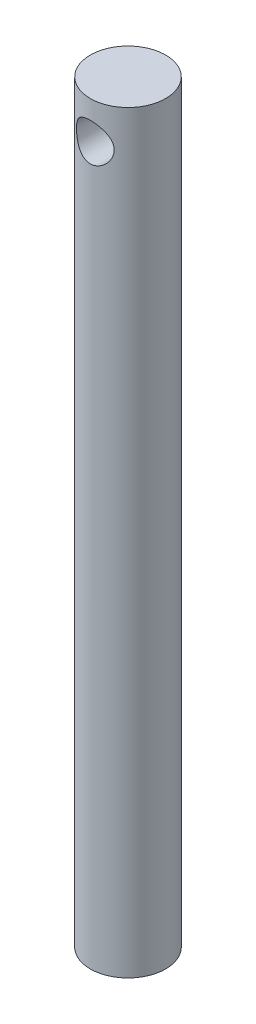
ISO-10303-21;
HEADER;
FILE_DESCRIPTION(('STEP AP214'),'2;1');
FILE_NAME('part.step','',(''),(''),'','','');
FILE_SCHEMA(('AUTOMOTIVE_DESIGN { 1 0 10303 214 1 1 1 1 }'));
ENDSEC;
DATA;
#1=APPLICATION_CONTEXT('core data for automotive mechanical design processes');
#2=APPLICATION_PROTOCOL_DEFINITION('international standard','automotive_design',2000,#1);
#3=PRODUCT_CONTEXT('',#1,'mechanical');
#4=PRODUCT('Part','Part','',(#3));
#5=PRODUCT_RELATED_PRODUCT_CATEGORY('part','',(#4));
#6=PRODUCT_DEFINITION_FORMATION('','',#4);
#7=PRODUCT_DEFINITION_CONTEXT('part definition',#1,'design');
#8=PRODUCT_DEFINITION('design','',#6,#7);
#9=PRODUCT_DEFINITION_SHAPE('','',#8);
#10=(LENGTH_UNIT() NAMED_UNIT(*) SI_UNIT(.MILLI.,.METRE.));
#11=(NAMED_UNIT(*) PLANE_ANGLE_UNIT() SI_UNIT($,.RADIAN.));
#12=(NAMED_UNIT(*) SI_UNIT($,.STERADIAN.) SOLID_ANGLE_UNIT());
#13=UNCERTAINTY_MEASURE_WITH_UNIT(LENGTH_MEASURE(1.E-05),#10,'distance_accuracy_value','');
#14=(GEOMETRIC_REPRESENTATION_CONTEXT(3) GLOBAL_UNCERTAINTY_ASSIGNED_CONTEXT((#13)) GLOBAL_UNIT_ASSIGNED_CONTEXT((#10,
#11,#12)) REPRESENTATION_CONTEXT('',''));
#15=CARTESIAN_POINT('',(0.,0.,0.));
#16=DIRECTION('',(0.,0.,1.));
#17=DIRECTION('',(1.,0.,0.));
#18=AXIS2_PLACEMENT_3D('',#15,#16,#17);
#19=CARTESIAN_POINT('',(0.,100.,0.));
#20=DIRECTION('',(0.,-1.,0.));
#21=DIRECTION('',(0.,0.,-1.));
#22=AXIS2_PLACEMENT_3D('',#19,#20,#21);
#23=CYLINDRICAL_SURFACE('',#22,5.);
#24=CARTESIAN_POINT('',(-2.50000000000001,95.,4.33012701892219));
#25=CARTESIAN_POINT('',(-2.49998948436432,94.8697334931235,4.33013982272991));
#26=CARTESIAN_POINT('',(-2.48974954513169,94.7392972793238,4.33609541965583));
#27=CARTESIAN_POINT('',(-2.44930840724944,94.4824310284708,4.35905877051907));
#28=CARTESIAN_POINT('',(-2.41906526369545,94.3560099959427,4.37608974726023));
#29=CARTESIAN_POINT('',(-2.34024976997571,94.1113710544389,4.41873376871658));
#30=CARTESIAN_POINT('',(-2.29177485369964,93.9931134264378,4.44430111338921));
#31=CARTESIAN_POINT('',(-2.17816884056414,93.7664394369054,4.50106659111455));
#32=CARTESIAN_POINT('',(-2.11303684262671,93.6580236082042,4.53226502875883));
#33=CARTESIAN_POINT('',(-1.96166634317253,93.4442356960831,4.59992173524851));
#34=CARTESIAN_POINT('',(-1.87413008816917,93.3398521655102,4.63660159331577));
#35=CARTESIAN_POINT('',(-1.68313452122752,93.1464790242868,4.70929956727453));
#36=CARTESIAN_POINT('',(-1.57966731506051,93.057497092245,4.74531734512768));
#37=CARTESIAN_POINT('',(-1.35122390789082,92.8915821235144,4.81553692452135));
#38=CARTESIAN_POINT('',(-1.22526797235894,92.8158655807209,4.84945266064072));
#39=CARTESIAN_POINT('',(-0.960392566671152,92.6871478665161,4.90876890230193));
#40=CARTESIAN_POINT('',(-0.82148134538999,92.6341323595615,4.93417477954535));
#41=CARTESIAN_POINT('',(-0.545112359773533,92.556238346836,4.9720115311507));
#42=CARTESIAN_POINT('',(-0.408254476210992,92.5296261841349,4.98523700553425));
#43=CARTESIAN_POINT('',(-0.131426571755684,92.4995847032887,5.00018959613973));
#44=CARTESIAN_POINT('',(0.00854151460650149,92.4961413580046,5.00192366961168));
#45=CARTESIAN_POINT('',(0.274581311061957,92.5118666849314,4.99407454791405));
#46=CARTESIAN_POINT('',(0.400802997942664,92.5290950388045,4.98546239730476));
#47=CARTESIAN_POINT('',(0.648284429795102,92.5822021097601,4.95935613149294));
#48=CARTESIAN_POINT('',(0.76954380273462,92.6180822224402,4.94186135165964));
#49=CARTESIAN_POINT('',(1.00577347892407,92.7077064152249,4.89928958219157));
#50=CARTESIAN_POINT('',(1.12063355878799,92.7616907829303,4.87411103823004));
#51=CARTESIAN_POINT('',(1.33994200378326,92.8856585405036,4.81844114966713));
#52=CARTESIAN_POINT('',(1.44438662209659,92.9556476582558,4.78794790393709));
#53=CARTESIAN_POINT('',(1.6504341522455,93.1172383788326,4.72110985998075));
#54=CARTESIAN_POINT('',(1.7508351875734,93.210257570815,4.68448439995438));
#55=CARTESIAN_POINT('',(1.93526092574444,93.4114743123254,4.61135851467029));
#56=CARTESIAN_POINT('',(2.01927302893557,93.5196834306851,4.57485820664072));
#57=CARTESIAN_POINT('',(2.17376333660553,93.7566204810602,4.50360390231212));
#58=CARTESIAN_POINT('',(2.24304328744513,93.8862150576355,4.46910799976769));
#59=CARTESIAN_POINT('',(2.35829778250308,94.1573441783975,4.4093862569644));
#60=CARTESIAN_POINT('',(2.40429664552722,94.2988660825439,4.38415075115168));
#61=CARTESIAN_POINT('',(2.4679505275626,94.578036278207,4.34861589542586));
#62=CARTESIAN_POINT('',(2.48756280529994,94.7151027976089,4.33729139621241));
#63=CARTESIAN_POINT('',(2.50379236652857,94.9910033537914,4.32794798404024));
#64=CARTESIAN_POINT('',(2.50042589328757,95.1298360727995,4.32991967223279));
#65=CARTESIAN_POINT('',(2.47259010835991,95.3891347964468,4.34585841351462));
#66=CARTESIAN_POINT('',(2.45046954178116,95.5099486277697,4.35848968766635));
#67=CARTESIAN_POINT('',(2.38924071158111,95.7459194656775,4.39235053878353));
#68=CARTESIAN_POINT('',(2.35012694655908,95.8610746268669,4.41358290012585));
#69=CARTESIAN_POINT('',(2.25411897151217,96.0885283272564,4.46340555199141));
#70=CARTESIAN_POINT('',(2.19648515923163,96.2004475421326,4.49229108107657));
#71=CARTESIAN_POINT('',(2.0657176600397,96.4136731788488,4.55390298743125));
#72=CARTESIAN_POINT('',(1.99257601083123,96.5149741087881,4.58663133387872));
#73=CARTESIAN_POINT('',(1.82209291799636,96.7174469188033,4.65719996140836));
#74=CARTESIAN_POINT('',(1.72286318078435,96.8169928767722,4.69516457885707));
#75=CARTESIAN_POINT('',(1.5085112384988,96.9985305950059,4.76835587444746));
#76=CARTESIAN_POINT('',(1.39338368664989,97.0805164256585,4.80358162519329));
#77=CARTESIAN_POINT('',(1.14633840638508,97.2264343147909,4.86853404227334));
#78=CARTESIAN_POINT('',(1.01405774389062,97.2898327952085,4.89809104179855));
#79=CARTESIAN_POINT('',(0.738805911647338,97.392844759962,4.9470838739847));
#80=CARTESIAN_POINT('',(0.595844253647071,97.4324791296051,4.96652859191746));
#81=CARTESIAN_POINT('',(0.317449205674709,97.4834214093564,4.99168770453968));
#82=CARTESIAN_POINT('',(0.18252860908538,97.4969946858304,4.99849819767838));
#83=CARTESIAN_POINT('',(-0.0878149643374271,97.5021081674946,5.00105325940467));
#84=CARTESIAN_POINT('',(-0.223237748727012,97.4936560856611,4.99680170177042));
#85=CARTESIAN_POINT('',(-0.481344982671069,97.4564589696045,4.97834922085637));
#86=CARTESIAN_POINT('',(-0.604280801321769,97.4290878283637,4.96482236636807));
#87=CARTESIAN_POINT('',(-0.843614873664451,97.3566825502417,4.92980234191731));
#88=CARTESIAN_POINT('',(-0.960012187087209,97.3116458803664,4.90830802955518));
#89=CARTESIAN_POINT('',(-1.18855854199592,97.2031821812607,4.85814826741488));
#90=CARTESIAN_POINT('',(-1.30031295715362,97.1390509753102,4.82921542506803));
#91=CARTESIAN_POINT('',(-1.51193650408535,96.9951058898524,4.76720333344986));
#92=CARTESIAN_POINT('',(-1.61180014305397,96.9152848073731,4.73412218229104));
#93=CARTESIAN_POINT('',(-1.80728542324369,96.7330042055506,4.66321523550925));
#94=CARTESIAN_POINT('',(-1.90149582349002,96.6290822739993,4.62524489658367));
#95=CARTESIAN_POINT('',(-2.07165660492503,96.4063847146178,4.55157698284941));
#96=CARTESIAN_POINT('',(-2.1475908315154,96.2875960858008,4.51588143910584));
#97=CARTESIAN_POINT('',(-2.28108393396029,96.0333638823358,4.44998982823926));
#98=CARTESIAN_POINT('',(-2.3379862797745,95.8975126115754,4.42000320346984));
#99=CARTESIAN_POINT('',(-2.40494911880459,95.6867773504802,4.38370272660093));
#100=CARTESIAN_POINT('',(-2.42419582683991,95.6154402243024,4.37305486646054));
#101=CARTESIAN_POINT('',(-2.45635087255789,95.4709593031507,4.35507574170935));
#102=CARTESIAN_POINT('',(-2.46926364179177,95.3978168090456,4.34774215854234));
#103=CARTESIAN_POINT('',(-2.48591166201424,95.2704990134531,4.3382377954292));
#104=CARTESIAN_POINT('',(-2.49118864979203,95.2165836784878,4.33520487024791));
#105=CARTESIAN_POINT('',(-2.49823512543934,95.1084553836896,4.33114674911322));
#106=CARTESIAN_POINT('',(-2.50000437866475,95.0542424041894,4.33012168747261));
#107=CARTESIAN_POINT('',(-2.50000000000001,95.,4.33012701892219));
#108=B_SPLINE_CURVE_WITH_KNOTS('',3,(#24,#25,#26,#27,#28,#29,#30,#31,#32,#33,#34,#35,#36,#37,
#38,#39,#40,#41,#42,#43,#44,#45,#46,#47,#48,#49,#50,#51,#52,#53,#54,#55,#56,#57,#58,#59,#60,#61,
#62,#63,#64,#65,#66,#67,#68,#69,#70,#71,#72,#73,#74,#75,#76,#77,#78,#79,#80,#81,#82,#83,#84,#85,
#86,#87,#88,#89,#90,#91,#92,#93,#94,#95,#96,#97,#98,#99,#100,#101,#102,#103,#104,#105,#106,
#107),.UNSPECIFIED.,.T.,.F.,(4,2,2,2,2,2,2,2,2,2,2,2,2,2,2,2,2,2,2,2,2,2,2,2,2,2,2,2,2,2,2,2,2,
2,2,2,2,2,2,2,2,4),(0.,0.390580306486802,0.781982232062008,1.17132148982694,1.56068181366371,
1.98215578129642,2.40383927716011,2.85394730601992,3.30377067414811,3.72158712424921,
4.13915059220184,4.52040243716429,4.90168281298721,5.2882383683295,5.67493248380763,
6.09817978647309,6.5217512061988,6.97222104328705,7.42221935534347,7.83655727140614,
8.25060232976017,8.61935458565149,8.98822631095242,9.37418241020304,9.76033715555203,
10.1951685895662,10.6301466245059,11.076604535375,11.5226694952701,11.927806759788,
12.3328021699001,12.7111106218382,13.0894733378512,13.4840187680376,13.8787457525688,
14.3127560463025,14.7471485711797,15.195268726016,15.4189244153949,15.6424233996907,
15.8050484542806,15.9676843870379),.UNSPECIFIED.);
#109=CARTESIAN_POINT('',(-2.50000000000001,95.,4.33012701892219));
#110=VERTEX_POINT('',#109);
#111=EDGE_CURVE('E50',#110,#110,#108,.T.);
#112=ORIENTED_EDGE('',*,*,#111,.F.);
#113=EDGE_LOOP('',(#112));
#114=FACE_BOUND('',#113,.T.);
#115=CARTESIAN_POINT('',(0.,100.,0.));
#116=DIRECTION('',(0.,1.,0.));
#117=DIRECTION('',(0.,0.,1.));
#118=AXIS2_PLACEMENT_3D('',#115,#116,#117);
#119=CIRCLE('',#118,5.);
#120=CARTESIAN_POINT('',(0.,100.,5.));
#121=VERTEX_POINT('',#120);
#122=EDGE_CURVE('E10',#121,#121,#119,.T.);
#123=ORIENTED_EDGE('',*,*,#122,.F.);
#124=EDGE_LOOP('',(#123));
#125=FACE_BOUND('',#124,.T.);
#126=CARTESIAN_POINT('',(0.,0.,0.));
#127=DIRECTION('',(0.,1.,0.));
#128=DIRECTION('',(0.,0.,1.));
#129=AXIS2_PLACEMENT_3D('',#126,#127,#128);
#130=CIRCLE('',#129,5.);
#131=CARTESIAN_POINT('',(0.,0.,5.));
#132=VERTEX_POINT('',#131);
#133=EDGE_CURVE('E44',#132,#132,#130,.T.);
#134=ORIENTED_EDGE('',*,*,#133,.T.);
#135=EDGE_LOOP('',(#134));
#136=FACE_BOUND('',#135,.T.);
#137=CARTESIAN_POINT('',(0.,97.5,-5.));
#138=CARTESIAN_POINT('',(0.131426682334305,97.499990330944,-4.99999177550472));
#139=CARTESIAN_POINT('',(0.263015634437213,97.489574438226,-4.99476199135277));
#140=CARTESIAN_POINT('',(0.522301454622884,97.448368178838,-4.9743541856102));
#141=CARTESIAN_POINT('',(0.649990448564106,97.417539119075,-4.9591572718767));
#142=CARTESIAN_POINT('',(0.897333631316202,97.3370153772812,-4.92040690922477));
#143=CARTESIAN_POINT('',(1.01701694536277,97.2873940122173,-4.89688595907259));
#144=CARTESIAN_POINT('',(1.2461816039967,97.1710734737482,-4.84364443325827));
#145=CARTESIAN_POINT('',(1.35566375203769,97.1043756468549,-4.81392434644421));
#146=CARTESIAN_POINT('',(1.56876952630998,96.9512068683574,-4.74890645050632));
#147=CARTESIAN_POINT('',(1.67163802294309,96.8637837997702,-4.71337997659091));
#148=CARTESIAN_POINT('',(1.86194861703333,96.6736963040147,-4.64149925776731));
#149=CARTESIAN_POINT('',(1.94937895911555,96.5710203711599,-4.60514440566897));
#150=CARTESIAN_POINT('',(2.11312999967247,96.3437916255547,-4.53247377945622));
#151=CARTESIAN_POINT('',(2.18806333849064,96.218159753965,-4.49637967412567));
#152=CARTESIAN_POINT('',(2.31542056761491,95.9540816602046,-4.43214946943555));
#153=CARTESIAN_POINT('',(2.36786053751683,95.8156446782374,-4.40400769020792));
#154=CARTESIAN_POINT('',(2.44533110537653,95.5383372364036,-4.36144667591402));
#155=CARTESIAN_POINT('',(2.47181464267579,95.3999888698204,-4.34630678958452));
#156=CARTESIAN_POINT('',(2.50106748329741,95.1200529055624,-4.3295472487215));
#157=CARTESIAN_POINT('',(2.50386022093906,94.9784686478249,-4.3279142335843));
#158=CARTESIAN_POINT('',(2.48671821792512,94.7142849392091,-4.33777325642937));
#159=CARTESIAN_POINT('',(2.46946139884055,94.5914399219417,-4.34771909154984));
#160=CARTESIAN_POINT('',(2.41734962264384,94.350695226568,-4.37690571834675));
#161=CARTESIAN_POINT('',(2.38248905974454,94.2327971367369,-4.39614947079454));
#162=CARTESIAN_POINT('',(2.29552445096459,94.0019271685857,-4.44218691031839));
#163=CARTESIAN_POINT('',(2.24303766778988,93.8891340030355,-4.46914601659992));
#164=CARTESIAN_POINT('',(2.12260421917012,93.673414268525,-4.52758510703513));
#165=CARTESIAN_POINT('',(2.0546506095312,93.5704921609998,-4.55906711950478));
#166=CARTESIAN_POINT('',(1.89516513728193,93.3636968681419,-4.62782894758213));
#167=CARTESIAN_POINT('',(1.80173614592319,93.2613578160596,-4.66533775591865));
#168=CARTESIAN_POINT('',(1.59888894685344,93.0731614535227,-4.73869058251019));
#169=CARTESIAN_POINT('',(1.48946314143571,92.9873120199153,-4.77453379897003));
#170=CARTESIAN_POINT('',(1.25129126457961,92.8307858474257,-4.84254968207409));
#171=CARTESIAN_POINT('',(1.12188397899852,92.7609988188857,-4.87447460405015));
#172=CARTESIAN_POINT('',(0.851165538721983,92.6447574273925,-4.92894702803109));
#173=CARTESIAN_POINT('',(0.709863940663162,92.5982845374621,-4.95150197358893));
#174=CARTESIAN_POINT('',(0.431916229151782,92.5338114907083,-4.98310834353579));
#175=CARTESIAN_POINT('',(0.295853826370907,92.513771910633,-4.9931234575324));
#176=CARTESIAN_POINT('',(0.0219489998732887,92.4963381721638,-5.00182533647794));
#177=CARTESIAN_POINT('',(-0.115892549675109,92.4989332859015,-5.00051746803426));
#178=CARTESIAN_POINT('',(-0.378082429964656,92.5255167210467,-4.98727980633468));
#179=CARTESIAN_POINT('',(-0.502648520123706,92.5478313318244,-4.97618114219992));
#180=CARTESIAN_POINT('',(-0.746017230755972,92.6105951797384,-4.94555428287529));
#181=CARTESIAN_POINT('',(-0.864819214231884,92.6510464161359,-4.92602515837625));
#182=CARTESIAN_POINT('',(-1.09722152111965,92.7499961660804,-4.87960628532329));
#183=CARTESIAN_POINT('',(-1.21057599249831,92.8089776252823,-4.85252204417873));
#184=CARTESIAN_POINT('',(-1.42615340426439,92.9427688391248,-4.7935993579975));
#185=CARTESIAN_POINT('',(-1.52837157450204,93.0175853365199,-4.76175888940534));
#186=CARTESIAN_POINT('',(-1.72941922315487,93.1894010632909,-4.69270553315086));
#187=CARTESIAN_POINT('',(-1.82693019428496,93.2878571709752,-4.65527212009488));
#188=CARTESIAN_POINT('',(-2.0046408025722,93.4998128780494,-4.58155978921587));
#189=CARTESIAN_POINT('',(-2.08482846428686,93.6133227970699,-4.54528168472407));
#190=CARTESIAN_POINT('',(-2.22926978618995,93.8591091354846,-4.47627980545279));
#191=CARTESIAN_POINT('',(-2.29256373922244,93.9920281652911,-4.44381323981254));
#192=CARTESIAN_POINT('',(-2.39520706511459,94.2687751688825,-4.38935180726745));
#193=CARTESIAN_POINT('',(-2.43458729077056,94.412588816,-4.36734345549014));
#194=CARTESIAN_POINT('',(-2.48465421767006,94.6922755573629,-4.33903752569351));
#195=CARTESIAN_POINT('',(-2.49773248744361,94.827585634119,-4.33143458674096));
#196=CARTESIAN_POINT('',(-2.50172288950899,95.0986176673807,-4.32913386592579));
#197=CARTESIAN_POINT('',(-2.49264462983266,95.2343394198736,-4.3344304902511));
#198=CARTESIAN_POINT('',(-2.45481530197332,95.4887087556169,-4.35594655164663));
#199=CARTESIAN_POINT('',(-2.42802074302697,95.6077511817208,-4.37107736338133));
#200=CARTESIAN_POINT('',(-2.35793843840544,95.8395202921999,-4.40927540337602));
#201=CARTESIAN_POINT('',(-2.31464538728733,95.9522449315665,-4.43234518434965));
#202=CARTESIAN_POINT('',(-2.20953919315539,96.1765621527197,-4.48571326433412));
#203=CARTESIAN_POINT('',(-2.14667719009404,96.287569851735,-4.5163930799845));
#204=CARTESIAN_POINT('',(-2.0053780838799,96.4981862432401,-4.58088327077455));
#205=CARTESIAN_POINT('',(-1.92693287765889,96.5977889626287,-4.61469526970766));
#206=CARTESIAN_POINT('',(-1.74550556946066,96.7953553637496,-4.6865581632701));
#207=CARTESIAN_POINT('',(-1.6407002246921,96.8916493641714,-4.7246249151498));
#208=CARTESIAN_POINT('',(-1.41539785420684,97.065655849428,-4.79694347383545));
#209=CARTESIAN_POINT('',(-1.29489242426333,97.1433583186059,-4.83119321905446));
#210=CARTESIAN_POINT('',(-1.03978808878537,97.2780969794841,-4.89245149457782));
#211=CARTESIAN_POINT('',(-0.905095560782293,97.3349831677845,-4.91940711437488));
#212=CARTESIAN_POINT('',(-0.696328709257355,97.4021838587924,-4.9517796092335));
#213=CARTESIAN_POINT('',(-0.625670413494093,97.4215553980018,-4.96122314081874));
#214=CARTESIAN_POINT('',(-0.482623997839264,97.4540659483706,-4.97717127275101));
#215=CARTESIAN_POINT('',(-0.410236963092409,97.4672087666764,-4.98367766823159));
#216=CARTESIAN_POINT('',(-0.281518684621679,97.4847374722846,-4.9923820076613));
#217=CARTESIAN_POINT('',(-0.225408499555451,97.4904549365313,-4.99523288466454));
#218=CARTESIAN_POINT('',(-0.112875528456292,97.4980883294657,-4.99904367329659));
#219=CARTESIAN_POINT('',(-0.0564527338382197,97.5000041532255,-5.00000353273198));
#220=CARTESIAN_POINT('',(0.,97.5,-5.));
#221=B_SPLINE_CURVE_WITH_KNOTS('',3,(#137,#138,#139,#140,#141,#142,#143,#144,#145,#146,#147,
#148,#149,#150,#151,#152,#153,#154,#155,#156,#157,#158,#159,#160,#161,#162,#163,#164,#165,#166,
#167,#168,#169,#170,#171,#172,#173,#174,#175,#176,#177,#178,#179,#180,#181,#182,#183,#184,#185,
#186,#187,#188,#189,#190,#191,#192,#193,#194,#195,#196,#197,#198,#199,#200,#201,#202,#203,#204,
#205,#206,#207,#208,#209,#210,#211,#212,#213,#214,#215,#216,#217,#218,#219,#220),.UNSPECIFIED.,
.T.,.F.,(4,2,2,2,2,2,2,2,2,2,2,2,2,2,2,2,2,2,2,2,2,2,2,2,2,2,2,2,2,2,2,2,2,2,2,2,2,2,2,2,2,4),
(0.,0.394060643550733,0.788870374272993,1.18215538873074,1.57540940145392,1.99245439679522,
2.40981559413508,2.85954316076881,3.30894869745702,3.73145030350575,4.15353393322552,
4.52514281023302,4.89687009814196,5.27725600421219,5.65781303150556,6.08662353334697,
6.51563836496718,6.96457555536103,7.413155422807,7.82458226178365,8.23581411278691,
8.61517266265306,8.9945730407733,9.38482140069748,9.7752362687085,10.2039902661037,
10.6330397153795,11.0828670540368,11.53211279863,11.9382326875699,12.3441764966107,
12.7114482562151,13.0788382197025,13.4709114195009,13.8631890285845,14.303131068923,
14.7433095845249,15.1866003415819,15.407934939208,15.6291340766844,15.7983933645035,
15.9676573239323),.UNSPECIFIED.);
#222=CARTESIAN_POINT('',(0.,97.5,-5.));
#223=VERTEX_POINT('',#222);
#224=EDGE_CURVE('E37',#223,#223,#221,.T.);
#225=ORIENTED_EDGE('',*,*,#224,.F.);
#226=EDGE_LOOP('',(#225));
#227=FACE_BOUND('',#226,.T.);
#228=ADVANCED_FACE('F33',(#114,#125,#136,#227),#23,.T.);
#229=CARTESIAN_POINT('',(0.,100.,0.));
#230=DIRECTION('',(0.,1.,0.));
#231=DIRECTION('',(0.,0.,1.));
#232=AXIS2_PLACEMENT_3D('',#229,#230,#231);
#233=PLANE('',#232);
#234=ORIENTED_EDGE('',*,*,#122,.T.);
#235=EDGE_LOOP('',(#234));
#236=FACE_BOUND('',#235,.T.);
#237=ADVANCED_FACE('F60',(#236),#233,.T.);
#238=CARTESIAN_POINT('',(0.,0.,0.));
#239=DIRECTION('',(0.,1.,0.));
#240=DIRECTION('',(0.,0.,1.));
#241=AXIS2_PLACEMENT_3D('',#238,#239,#240);
#242=PLANE('',#241);
#243=ORIENTED_EDGE('',*,*,#133,.F.);
#244=EDGE_LOOP('',(#243));
#245=FACE_BOUND('',#244,.T.);
#246=ADVANCED_FACE('F58',(#245),#242,.F.);
#247=CARTESIAN_POINT('',(0.,95.,10.));
#248=DIRECTION('',(0.,0.,-1.));
#249=DIRECTION('',(-1.,0.,0.));
#250=AXIS2_PLACEMENT_3D('',#247,#248,#249);
#251=CYLINDRICAL_SURFACE('',#250,2.5);
#252=ORIENTED_EDGE('',*,*,#111,.T.);
#253=EDGE_LOOP('',(#252));
#254=FACE_BOUND('',#253,.T.);
#255=ORIENTED_EDGE('',*,*,#224,.T.);
#256=EDGE_LOOP('',(#255));
#257=FACE_BOUND('',#256,.T.);
#258=ADVANCED_FACE('F54',(#254,#257),#251,.F.);
#259=CLOSED_SHELL('',(#228,#237,#246,#258));
#260=MANIFOLD_SOLID_BREP('B2',#259);
#261=ADVANCED_BREP_SHAPE_REPRESENTATION('',(#18,#260),#14);
#262=SHAPE_DEFINITION_REPRESENTATION(#9,#261);
ENDSEC;
END-ISO-10303-21;
